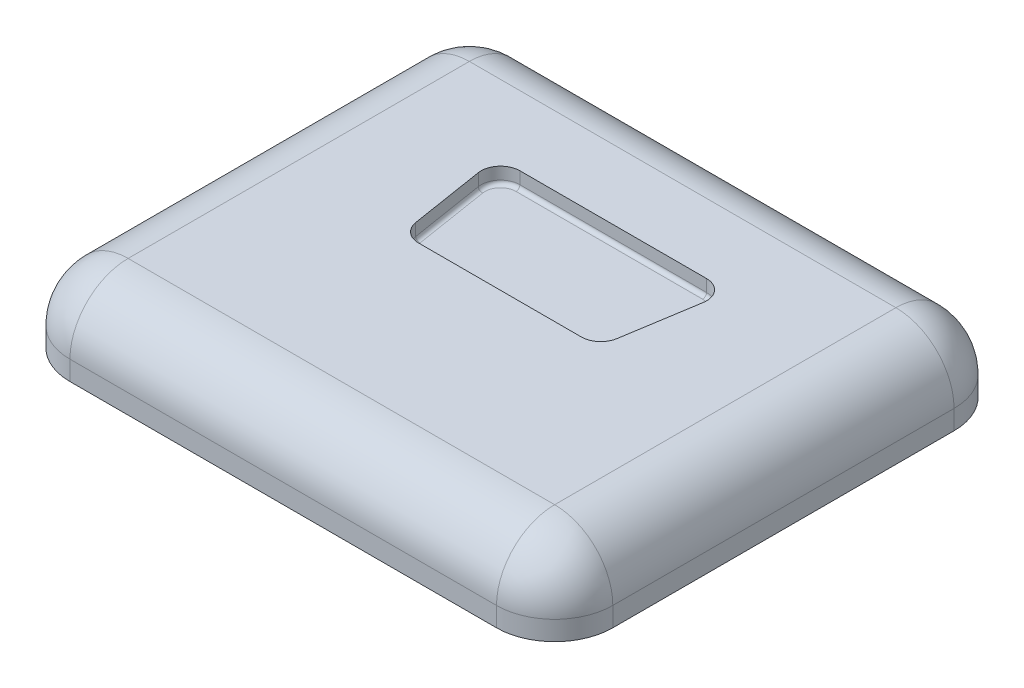
ISO-10303-21;
HEADER;
FILE_DESCRIPTION(('STEP AP214'),'2;1');
FILE_NAME('part.step','',(''),(''),'','','');
FILE_SCHEMA(('AUTOMOTIVE_DESIGN { 1 0 10303 214 1 1 1 1 }'));
ENDSEC;
DATA;
#1=APPLICATION_CONTEXT('core data for automotive mechanical design processes');
#2=APPLICATION_PROTOCOL_DEFINITION('international standard','automotive_design',2000,#1);
#3=PRODUCT_CONTEXT('',#1,'mechanical');
#4=PRODUCT('Part','Part','',(#3));
#5=PRODUCT_RELATED_PRODUCT_CATEGORY('part','',(#4));
#6=PRODUCT_DEFINITION_FORMATION('','',#4);
#7=PRODUCT_DEFINITION_CONTEXT('part definition',#1,'design');
#8=PRODUCT_DEFINITION('design','',#6,#7);
#9=PRODUCT_DEFINITION_SHAPE('','',#8);
#10=(LENGTH_UNIT() NAMED_UNIT(*) SI_UNIT(.MILLI.,.METRE.));
#11=(NAMED_UNIT(*) PLANE_ANGLE_UNIT() SI_UNIT($,.RADIAN.));
#12=(NAMED_UNIT(*) SI_UNIT($,.STERADIAN.) SOLID_ANGLE_UNIT());
#13=UNCERTAINTY_MEASURE_WITH_UNIT(LENGTH_MEASURE(1.E-05),#10,'distance_accuracy_value','');
#14=(GEOMETRIC_REPRESENTATION_CONTEXT(3) GLOBAL_UNCERTAINTY_ASSIGNED_CONTEXT((#13)) GLOBAL_UNIT_ASSIGNED_CONTEXT((#10,
#11,#12)) REPRESENTATION_CONTEXT('',''));
#15=CARTESIAN_POINT('',(0.,0.,0.));
#16=DIRECTION('',(0.,0.,1.));
#17=DIRECTION('',(1.,0.,0.));
#18=AXIS2_PLACEMENT_3D('',#15,#16,#17);
#19=CARTESIAN_POINT('',(-112.56,40.,-82.94));
#20=DIRECTION('',(1.,0.,0.));
#21=DIRECTION('',(0.,0.,-1.));
#22=AXIS2_PLACEMENT_3D('',#19,#20,#21);
#23=PLANE('',#22);
#24=DIRECTION('',(0.,0.,1.));
#25=VECTOR('',#24,1.);
#26=CARTESIAN_POINT('',(-112.56,10.,-82.94));
#27=LINE('',#26,#25);
#28=CARTESIAN_POINT('',(-112.56,10.,123.06));
#29=VERTEX_POINT('',#28);
#30=CARTESIAN_POINT('',(-112.56,10.,-52.94));
#31=VERTEX_POINT('',#30);
#32=EDGE_CURVE('E319',#29,#31,#27,.F.);
#33=ORIENTED_EDGE('',*,*,#32,.T.);
#34=DIRECTION('',(0.,-1.,0.));
#35=VECTOR('',#34,1.);
#36=CARTESIAN_POINT('',(-112.56,0.,-52.94));
#37=LINE('',#36,#35);
#38=CARTESIAN_POINT('',(-112.56,0.,-52.94));
#39=VERTEX_POINT('',#38);
#40=EDGE_CURVE('E322',#31,#39,#37,.T.);
#41=ORIENTED_EDGE('',*,*,#40,.T.);
#42=DIRECTION('',(0.,0.,1.));
#43=VECTOR('',#42,1.);
#44=CARTESIAN_POINT('',(-112.56,0.,-82.94));
#45=LINE('',#44,#43);
#46=CARTESIAN_POINT('',(-112.56,0.,123.06));
#47=VERTEX_POINT('',#46);
#48=EDGE_CURVE('E258',#39,#47,#45,.T.);
#49=ORIENTED_EDGE('',*,*,#48,.T.);
#50=DIRECTION('',(0.,-1.,0.));
#51=VECTOR('',#50,1.);
#52=CARTESIAN_POINT('',(-112.56,40.,123.06));
#53=LINE('',#52,#51);
#54=EDGE_CURVE('E316',#47,#29,#53,.F.);
#55=ORIENTED_EDGE('',*,*,#54,.T.);
#56=EDGE_LOOP('',(#33,#41,#49,#55));
#57=FACE_BOUND('',#56,.T.);
#58=ADVANCED_FACE('F42',(#57),#23,.F.);
#59=CARTESIAN_POINT('',(-112.56,40.,153.06));
#60=DIRECTION('',(0.,0.,-1.));
#61=DIRECTION('',(-1.,0.,0.));
#62=AXIS2_PLACEMENT_3D('',#59,#60,#61);
#63=PLANE('',#62);
#64=DIRECTION('',(1.,0.,0.));
#65=VECTOR('',#64,1.);
#66=CARTESIAN_POINT('',(-112.56,10.,153.06));
#67=LINE('',#66,#65);
#68=CARTESIAN_POINT('',(137.44,10.,153.06));
#69=VERTEX_POINT('',#68);
#70=CARTESIAN_POINT('',(-82.5599999999999,10.,153.06));
#71=VERTEX_POINT('',#70);
#72=EDGE_CURVE('E310',#69,#71,#67,.F.);
#73=ORIENTED_EDGE('',*,*,#72,.T.);
#74=DIRECTION('',(0.,-1.,0.));
#75=VECTOR('',#74,1.);
#76=CARTESIAN_POINT('',(-82.5599999999999,40.,153.06));
#77=LINE('',#76,#75);
#78=CARTESIAN_POINT('',(-82.5599999999999,0.,153.06));
#79=VERTEX_POINT('',#78);
#80=EDGE_CURVE('E313',#71,#79,#77,.T.);
#81=ORIENTED_EDGE('',*,*,#80,.T.);
#82=DIRECTION('',(1.,0.,0.));
#83=VECTOR('',#82,1.);
#84=CARTESIAN_POINT('',(-112.56,0.,153.06));
#85=LINE('',#84,#83);
#86=CARTESIAN_POINT('',(137.44,0.,153.06));
#87=VERTEX_POINT('',#86);
#88=EDGE_CURVE('E262',#79,#87,#85,.T.);
#89=ORIENTED_EDGE('',*,*,#88,.T.);
#90=DIRECTION('',(0.,-1.,0.));
#91=VECTOR('',#90,1.);
#92=CARTESIAN_POINT('',(137.44,40.,153.06));
#93=LINE('',#92,#91);
#94=EDGE_CURVE('E307',#87,#69,#93,.F.);
#95=ORIENTED_EDGE('',*,*,#94,.T.);
#96=EDGE_LOOP('',(#73,#81,#89,#95));
#97=FACE_BOUND('',#96,.T.);
#98=ADVANCED_FACE('F520',(#97),#63,.F.);
#99=CARTESIAN_POINT('',(167.44,40.,-82.94));
#100=DIRECTION('',(1.,0.,0.));
#101=DIRECTION('',(0.,0.,-1.));
#102=AXIS2_PLACEMENT_3D('',#99,#100,#101);
#103=PLANE('',#102);
#104=DIRECTION('',(0.,0.,1.));
#105=VECTOR('',#104,1.);
#106=CARTESIAN_POINT('',(167.44,0.,-82.94));
#107=LINE('',#106,#105);
#108=CARTESIAN_POINT('',(167.44,0.,-52.94));
#109=VERTEX_POINT('',#108);
#110=CARTESIAN_POINT('',(167.44,0.,123.06));
#111=VERTEX_POINT('',#110);
#112=EDGE_CURVE('E267',#109,#111,#107,.T.);
#113=ORIENTED_EDGE('',*,*,#112,.F.);
#114=DIRECTION('',(0.,-1.,0.));
#115=VECTOR('',#114,1.);
#116=CARTESIAN_POINT('',(167.44,40.,-52.94));
#117=LINE('',#116,#115);
#118=CARTESIAN_POINT('',(167.44,10.,-52.94));
#119=VERTEX_POINT('',#118);
#120=EDGE_CURVE('E304',#109,#119,#117,.F.);
#121=ORIENTED_EDGE('',*,*,#120,.T.);
#122=DIRECTION('',(0.,0.,1.));
#123=VECTOR('',#122,1.);
#124=CARTESIAN_POINT('',(167.44,10.,-82.94));
#125=LINE('',#124,#123);
#126=CARTESIAN_POINT('',(167.44,10.,123.06));
#127=VERTEX_POINT('',#126);
#128=EDGE_CURVE('E301',#119,#127,#125,.T.);
#129=ORIENTED_EDGE('',*,*,#128,.T.);
#130=DIRECTION('',(0.,-1.,0.));
#131=VECTOR('',#130,1.);
#132=CARTESIAN_POINT('',(167.44,0.,123.06));
#133=LINE('',#132,#131);
#134=EDGE_CURVE('E298',#127,#111,#133,.T.);
#135=ORIENTED_EDGE('',*,*,#134,.T.);
#136=EDGE_LOOP('',(#113,#121,#129,#135));
#137=FACE_BOUND('',#136,.T.);
#138=ADVANCED_FACE('F526',(#137),#103,.T.);
#139=CARTESIAN_POINT('',(-112.56,40.,-82.94));
#140=DIRECTION('',(0.,0.,-1.));
#141=DIRECTION('',(-1.,0.,0.));
#142=AXIS2_PLACEMENT_3D('',#139,#140,#141);
#143=PLANE('',#142);
#144=DIRECTION('',(1.,0.,0.));
#145=VECTOR('',#144,1.);
#146=CARTESIAN_POINT('',(-112.56,10.,-82.94));
#147=LINE('',#146,#145);
#148=CARTESIAN_POINT('',(-82.5599999999999,10.,-82.94));
#149=VERTEX_POINT('',#148);
#150=CARTESIAN_POINT('',(137.44,10.,-82.94));
#151=VERTEX_POINT('',#150);
#152=EDGE_CURVE('E278',#149,#151,#147,.T.);
#153=ORIENTED_EDGE('',*,*,#152,.T.);
#154=DIRECTION('',(0.,-1.,0.));
#155=VECTOR('',#154,1.);
#156=CARTESIAN_POINT('',(137.44,40.,-82.94));
#157=LINE('',#156,#155);
#158=CARTESIAN_POINT('',(137.44,0.,-82.94));
#159=VERTEX_POINT('',#158);
#160=EDGE_CURVE('E282',#151,#159,#157,.T.);
#161=ORIENTED_EDGE('',*,*,#160,.T.);
#162=DIRECTION('',(1.,0.,0.));
#163=VECTOR('',#162,1.);
#164=CARTESIAN_POINT('',(-112.56,0.,-82.94));
#165=LINE('',#164,#163);
#166=CARTESIAN_POINT('',(-82.5599999999999,0.,-82.94));
#167=VERTEX_POINT('',#166);
#168=EDGE_CURVE('E271',#167,#159,#165,.T.);
#169=ORIENTED_EDGE('',*,*,#168,.F.);
#170=DIRECTION('',(0.,-1.,0.));
#171=VECTOR('',#170,1.);
#172=CARTESIAN_POINT('',(-82.5599999999999,40.,-82.94));
#173=LINE('',#172,#171);
#174=EDGE_CURVE('E275',#167,#149,#173,.F.);
#175=ORIENTED_EDGE('',*,*,#174,.T.);
#176=EDGE_LOOP('',(#153,#161,#169,#175));
#177=FACE_BOUND('',#176,.T.);
#178=ADVANCED_FACE('F833',(#177),#143,.T.);
#179=CARTESIAN_POINT('',(0.,40.,0.));
#180=DIRECTION('',(0.,1.,0.));
#181=DIRECTION('',(0.,0.,1.));
#182=AXIS2_PLACEMENT_3D('',#179,#180,#181);
#183=PLANE('',#182);
#184=CARTESIAN_POINT('',(-14.5599999999999,40.,31.26));
#185=DIRECTION('',(0.,1.,0.));
#186=DIRECTION('',(0.,0.,1.));
#187=AXIS2_PLACEMENT_3D('',#184,#185,#186);
#188=CIRCLE('',#187,10.);
#189=CARTESIAN_POINT('',(-24.4351744166853,40.,32.83509689862));
#190=VERTEX_POINT('',#189);
#191=CARTESIAN_POINT('',(-14.5599999999999,40.,41.26));
#192=VERTEX_POINT('',#191);
#193=EDGE_CURVE('E209',#190,#192,#188,.T.);
#194=ORIENTED_EDGE('',*,*,#193,.F.);
#195=DIRECTION('',(0.157509689862002,0.,0.987517441668539));
#196=VECTOR('',#195,1.);
#197=CARTESIAN_POINT('',(-30.5599999999999,40.,-5.56490310137999));
#198=LINE('',#197,#196);
#199=CARTESIAN_POINT('',(-30.5599999999999,40.,-5.56490310137999));
#200=VERTEX_POINT('',#199);
#201=EDGE_CURVE('E234',#200,#190,#198,.T.);
#202=ORIENTED_EDGE('',*,*,#201,.F.);
#203=CARTESIAN_POINT('',(-20.6848255833145,40.,-7.14000000000001));
#204=DIRECTION('',(0.,1.,0.));
#205=DIRECTION('',(0.,0.,1.));
#206=AXIS2_PLACEMENT_3D('',#203,#204,#205);
#207=CIRCLE('',#206,10.);
#208=CARTESIAN_POINT('',(-20.6848255833145,40.,-17.14));
#209=VERTEX_POINT('',#208);
#210=EDGE_CURVE('E230',#209,#200,#207,.T.);
#211=ORIENTED_EDGE('',*,*,#210,.F.);
#212=DIRECTION('',(-1.,0.,0.));
#213=VECTOR('',#212,1.);
#214=CARTESIAN_POINT('',(-20.6848255833145,40.,-17.14));
#215=LINE('',#214,#213);
#216=CARTESIAN_POINT('',(75.5648255833147,40.,-17.14));
#217=VERTEX_POINT('',#216);
#218=EDGE_CURVE('E226',#217,#209,#215,.T.);
#219=ORIENTED_EDGE('',*,*,#218,.F.);
#220=CARTESIAN_POINT('',(75.5648255833147,40.,-7.14000000000001));
#221=DIRECTION('',(0.,1.,0.));
#222=DIRECTION('',(0.,0.,-1.));
#223=AXIS2_PLACEMENT_3D('',#220,#221,#222);
#224=CIRCLE('',#223,10.);
#225=CARTESIAN_POINT('',(85.4400000000001,40.,-5.56490310137999));
#226=VERTEX_POINT('',#225);
#227=EDGE_CURVE('E219',#226,#217,#224,.T.);
#228=ORIENTED_EDGE('',*,*,#227,.F.);
#229=DIRECTION('',(0.157509689862002,0.,-0.987517441668539));
#230=VECTOR('',#229,1.);
#231=CARTESIAN_POINT('',(85.4400000000001,40.,-5.56490310137999));
#232=LINE('',#231,#230);
#233=CARTESIAN_POINT('',(79.3151744166855,40.,32.83509689862));
#234=VERTEX_POINT('',#233);
#235=EDGE_CURVE('E215',#234,#226,#232,.T.);
#236=ORIENTED_EDGE('',*,*,#235,.F.);
#237=CARTESIAN_POINT('',(69.4400000000001,40.,31.26));
#238=DIRECTION('',(0.,1.,0.));
#239=DIRECTION('',(0.,0.,1.));
#240=AXIS2_PLACEMENT_3D('',#237,#238,#239);
#241=CIRCLE('',#240,10.);
#242=CARTESIAN_POINT('',(69.4400000000001,40.,41.26));
#243=VERTEX_POINT('',#242);
#244=EDGE_CURVE('E195',#243,#234,#241,.T.);
#245=ORIENTED_EDGE('',*,*,#244,.F.);
#246=DIRECTION('',(1.,0.,0.));
#247=VECTOR('',#246,1.);
#248=CARTESIAN_POINT('',(-14.5599999999999,40.,41.26));
#249=LINE('',#248,#247);
#250=EDGE_CURVE('E203',#192,#243,#249,.T.);
#251=ORIENTED_EDGE('',*,*,#250,.F.);
#252=EDGE_LOOP('',(#194,#202,#211,#219,#228,#236,#245,#251));
#253=FACE_BOUND('',#252,.T.);
#254=DIRECTION('',(0.,0.,1.));
#255=VECTOR('',#254,1.);
#256=CARTESIAN_POINT('',(137.44,40.,0.));
#257=LINE('',#256,#255);
#258=CARTESIAN_POINT('',(137.44,40.,123.06));
#259=VERTEX_POINT('',#258);
#260=CARTESIAN_POINT('',(137.44,40.,-52.94));
#261=VERTEX_POINT('',#260);
#262=EDGE_CURVE('E291',#259,#261,#257,.F.);
#263=ORIENTED_EDGE('',*,*,#262,.T.);
#264=DIRECTION('',(1.,0.,0.));
#265=VECTOR('',#264,1.);
#266=CARTESIAN_POINT('',(0.,40.,-52.94));
#267=LINE('',#266,#265);
#268=CARTESIAN_POINT('',(-82.5599999999999,40.,-52.94));
#269=VERTEX_POINT('',#268);
#270=EDGE_CURVE('E294',#261,#269,#267,.F.);
#271=ORIENTED_EDGE('',*,*,#270,.T.);
#272=DIRECTION('',(0.,0.,1.));
#273=VECTOR('',#272,1.);
#274=CARTESIAN_POINT('',(-82.5599999999999,40.,153.06));
#275=LINE('',#274,#273);
#276=CARTESIAN_POINT('',(-82.5599999999999,40.,123.06));
#277=VERTEX_POINT('',#276);
#278=EDGE_CURVE('E285',#269,#277,#275,.T.);
#279=ORIENTED_EDGE('',*,*,#278,.T.);
#280=DIRECTION('',(1.,0.,0.));
#281=VECTOR('',#280,1.);
#282=CARTESIAN_POINT('',(167.44,40.,123.06));
#283=LINE('',#282,#281);
#284=EDGE_CURVE('E288',#277,#259,#283,.T.);
#285=ORIENTED_EDGE('',*,*,#284,.T.);
#286=EDGE_LOOP('',(#263,#271,#279,#285));
#287=FACE_BOUND('',#286,.T.);
#288=ADVANCED_FACE('F211',(#253,#287),#183,.T.);
#289=CARTESIAN_POINT('',(0.,0.,0.));
#290=DIRECTION('',(0.,1.,0.));
#291=DIRECTION('',(0.,0.,1.));
#292=AXIS2_PLACEMENT_3D('',#289,#290,#291);
#293=PLANE('',#292);
#294=ORIENTED_EDGE('',*,*,#168,.T.);
#295=CARTESIAN_POINT('',(137.44,0.,-52.94));
#296=DIRECTION('',(0.,1.,0.));
#297=DIRECTION('',(0.,0.,1.));
#298=AXIS2_PLACEMENT_3D('',#295,#296,#297);
#299=CIRCLE('',#298,30.);
#300=EDGE_CURVE('E334',#159,#109,#299,.F.);
#301=ORIENTED_EDGE('',*,*,#300,.T.);
#302=ORIENTED_EDGE('',*,*,#112,.T.);
#303=CARTESIAN_POINT('',(137.44,0.,123.06));
#304=DIRECTION('',(0.,1.,0.));
#305=DIRECTION('',(0.,0.,1.));
#306=AXIS2_PLACEMENT_3D('',#303,#304,#305);
#307=CIRCLE('',#306,30.);
#308=EDGE_CURVE('E325',#111,#87,#307,.F.);
#309=ORIENTED_EDGE('',*,*,#308,.T.);
#310=ORIENTED_EDGE('',*,*,#88,.F.);
#311=CARTESIAN_POINT('',(-82.5599999999999,0.,123.06));
#312=DIRECTION('',(0.,1.,0.));
#313=DIRECTION('',(0.,0.,1.));
#314=AXIS2_PLACEMENT_3D('',#311,#312,#313);
#315=CIRCLE('',#314,30.);
#316=EDGE_CURVE('E328',#79,#47,#315,.F.);
#317=ORIENTED_EDGE('',*,*,#316,.T.);
#318=ORIENTED_EDGE('',*,*,#48,.F.);
#319=CARTESIAN_POINT('',(-82.5599999999999,0.,-52.94));
#320=DIRECTION('',(0.,1.,0.));
#321=DIRECTION('',(0.,0.,1.));
#322=AXIS2_PLACEMENT_3D('',#319,#320,#321);
#323=CIRCLE('',#322,30.);
#324=EDGE_CURVE('E331',#39,#167,#323,.F.);
#325=ORIENTED_EDGE('',*,*,#324,.T.);
#326=EDGE_LOOP('',(#294,#301,#302,#309,#310,#317,#318,#325));
#327=FACE_BOUND('',#326,.T.);
#328=ADVANCED_FACE('F578',(#327),#293,.F.);
#329=CARTESIAN_POINT('',(-82.5599999999999,40.,123.06));
#330=DIRECTION('',(0.,-1.,0.));
#331=DIRECTION('',(0.,0.,-1.));
#332=AXIS2_PLACEMENT_3D('',#329,#330,#331);
#333=CYLINDRICAL_SURFACE('',#332,30.);
#334=ORIENTED_EDGE('',*,*,#316,.F.);
#335=ORIENTED_EDGE('',*,*,#80,.F.);
#336=CARTESIAN_POINT('',(-82.5599999999999,10.,123.06));
#337=DIRECTION('',(0.,1.,0.));
#338=DIRECTION('',(0.,0.,1.));
#339=AXIS2_PLACEMENT_3D('',#336,#337,#338);
#340=CIRCLE('',#339,30.);
#341=EDGE_CURVE('E375',#29,#71,#340,.T.);
#342=ORIENTED_EDGE('',*,*,#341,.F.);
#343=ORIENTED_EDGE('',*,*,#54,.F.);
#344=EDGE_LOOP('',(#334,#335,#342,#343));
#345=FACE_BOUND('',#344,.T.);
#346=ADVANCED_FACE('F574',(#345),#333,.T.);
#347=CARTESIAN_POINT('',(137.44,40.,123.06));
#348=DIRECTION('',(0.,1.,0.));
#349=DIRECTION('',(0.,0.,1.));
#350=AXIS2_PLACEMENT_3D('',#347,#348,#349);
#351=CYLINDRICAL_SURFACE('',#350,30.);
#352=ORIENTED_EDGE('',*,*,#308,.F.);
#353=ORIENTED_EDGE('',*,*,#134,.F.);
#354=CARTESIAN_POINT('',(137.44,10.,123.06));
#355=DIRECTION('',(0.,1.,0.));
#356=DIRECTION('',(0.,0.,1.));
#357=AXIS2_PLACEMENT_3D('',#354,#355,#356);
#358=CIRCLE('',#357,30.);
#359=EDGE_CURVE('E371',#69,#127,#358,.T.);
#360=ORIENTED_EDGE('',*,*,#359,.F.);
#361=ORIENTED_EDGE('',*,*,#94,.F.);
#362=EDGE_LOOP('',(#352,#353,#360,#361));
#363=FACE_BOUND('',#362,.T.);
#364=ADVANCED_FACE('F570',(#363),#351,.T.);
#365=CARTESIAN_POINT('',(0.,10.,123.06));
#366=DIRECTION('',(-1.,0.,0.));
#367=DIRECTION('',(0.,0.,1.));
#368=AXIS2_PLACEMENT_3D('',#365,#366,#367);
#369=CYLINDRICAL_SURFACE('',#368,30.);
#370=CARTESIAN_POINT('',(-82.5599999999999,10.,123.06));
#371=DIRECTION('',(-1.,0.,0.));
#372=DIRECTION('',(0.,0.,1.));
#373=AXIS2_PLACEMENT_3D('',#370,#371,#372);
#374=CIRCLE('',#373,30.);
#375=EDGE_CURVE('E263',#71,#277,#374,.T.);
#376=ORIENTED_EDGE('',*,*,#375,.F.);
#377=ORIENTED_EDGE('',*,*,#72,.F.);
#378=CARTESIAN_POINT('',(137.44,10.,123.06));
#379=DIRECTION('',(1.,0.,0.));
#380=DIRECTION('',(0.,0.,-1.));
#381=AXIS2_PLACEMENT_3D('',#378,#379,#380);
#382=CIRCLE('',#381,30.);
#383=EDGE_CURVE('E367',#259,#69,#382,.T.);
#384=ORIENTED_EDGE('',*,*,#383,.F.);
#385=ORIENTED_EDGE('',*,*,#284,.F.);
#386=EDGE_LOOP('',(#376,#377,#384,#385));
#387=FACE_BOUND('',#386,.T.);
#388=ADVANCED_FACE('F566',(#387),#369,.T.);
#389=CARTESIAN_POINT('',(-82.5599999999999,10.,123.06));
#390=DIRECTION('',(0.,0.,1.));
#391=DIRECTION('',(1.,0.,0.));
#392=AXIS2_PLACEMENT_3D('',#389,#390,#391);
#393=SPHERICAL_SURFACE('',#392,30.);
#394=ORIENTED_EDGE('',*,*,#341,.T.);
#395=ORIENTED_EDGE('',*,*,#375,.T.);
#396=CARTESIAN_POINT('',(-82.5599999999999,10.,123.06));
#397=DIRECTION('',(0.,0.,1.));
#398=DIRECTION('',(1.,0.,0.));
#399=AXIS2_PLACEMENT_3D('',#396,#397,#398);
#400=CIRCLE('',#399,30.);
#401=EDGE_CURVE('E363',#29,#277,#400,.F.);
#402=ORIENTED_EDGE('',*,*,#401,.F.);
#403=EDGE_LOOP('',(#394,#395,#402));
#404=FACE_BOUND('',#403,.T.);
#405=ADVANCED_FACE('F562',(#404),#393,.T.);
#406=CARTESIAN_POINT('',(137.44,10.,123.06));
#407=DIRECTION('',(0.,0.,1.));
#408=DIRECTION('',(1.,0.,0.));
#409=AXIS2_PLACEMENT_3D('',#406,#407,#408);
#410=SPHERICAL_SURFACE('',#409,30.);
#411=ORIENTED_EDGE('',*,*,#383,.T.);
#412=ORIENTED_EDGE('',*,*,#359,.T.);
#413=CARTESIAN_POINT('',(137.44,10.,123.06));
#414=DIRECTION('',(0.,0.,1.));
#415=DIRECTION('',(1.,0.,0.));
#416=AXIS2_PLACEMENT_3D('',#413,#414,#415);
#417=CIRCLE('',#416,30.);
#418=EDGE_CURVE('E359',#259,#127,#417,.F.);
#419=ORIENTED_EDGE('',*,*,#418,.F.);
#420=EDGE_LOOP('',(#411,#412,#419));
#421=FACE_BOUND('',#420,.T.);
#422=ADVANCED_FACE('F558',(#421),#410,.T.);
#423=CARTESIAN_POINT('',(-82.5599999999999,10.,0.));
#424=DIRECTION('',(0.,0.,-1.));
#425=DIRECTION('',(-1.,0.,0.));
#426=AXIS2_PLACEMENT_3D('',#423,#424,#425);
#427=CYLINDRICAL_SURFACE('',#426,30.);
#428=ORIENTED_EDGE('',*,*,#401,.T.);
#429=ORIENTED_EDGE('',*,*,#278,.F.);
#430=CARTESIAN_POINT('',(-82.5599999999999,10.,-52.94));
#431=DIRECTION('',(0.,0.,-1.));
#432=DIRECTION('',(-1.,0.,0.));
#433=AXIS2_PLACEMENT_3D('',#430,#431,#432);
#434=CIRCLE('',#433,30.);
#435=EDGE_CURVE('E355',#31,#269,#434,.T.);
#436=ORIENTED_EDGE('',*,*,#435,.F.);
#437=ORIENTED_EDGE('',*,*,#32,.F.);
#438=EDGE_LOOP('',(#428,#429,#436,#437));
#439=FACE_BOUND('',#438,.T.);
#440=ADVANCED_FACE('F554',(#439),#427,.T.);
#441=CARTESIAN_POINT('',(-82.5599999999999,40.,-52.94));
#442=DIRECTION('',(0.,1.,0.));
#443=DIRECTION('',(0.,0.,1.));
#444=AXIS2_PLACEMENT_3D('',#441,#442,#443);
#445=CYLINDRICAL_SURFACE('',#444,30.);
#446=ORIENTED_EDGE('',*,*,#324,.F.);
#447=ORIENTED_EDGE('',*,*,#40,.F.);
#448=CARTESIAN_POINT('',(-82.5599999999999,10.,-52.94));
#449=DIRECTION('',(0.,1.,0.));
#450=DIRECTION('',(0.,0.,1.));
#451=AXIS2_PLACEMENT_3D('',#448,#449,#450);
#452=CIRCLE('',#451,30.);
#453=EDGE_CURVE('E351',#149,#31,#452,.T.);
#454=ORIENTED_EDGE('',*,*,#453,.F.);
#455=ORIENTED_EDGE('',*,*,#174,.F.);
#456=EDGE_LOOP('',(#446,#447,#454,#455));
#457=FACE_BOUND('',#456,.T.);
#458=ADVANCED_FACE('F550',(#457),#445,.T.);
#459=CARTESIAN_POINT('',(137.44,40.,-52.94));
#460=DIRECTION('',(0.,-1.,0.));
#461=DIRECTION('',(0.,0.,-1.));
#462=AXIS2_PLACEMENT_3D('',#459,#460,#461);
#463=CYLINDRICAL_SURFACE('',#462,30.);
#464=ORIENTED_EDGE('',*,*,#300,.F.);
#465=ORIENTED_EDGE('',*,*,#160,.F.);
#466=CARTESIAN_POINT('',(137.44,10.,-52.94));
#467=DIRECTION('',(0.,1.,0.));
#468=DIRECTION('',(0.,0.,1.));
#469=AXIS2_PLACEMENT_3D('',#466,#467,#468);
#470=CIRCLE('',#469,30.);
#471=EDGE_CURVE('E347',#119,#151,#470,.T.);
#472=ORIENTED_EDGE('',*,*,#471,.F.);
#473=ORIENTED_EDGE('',*,*,#120,.F.);
#474=EDGE_LOOP('',(#464,#465,#472,#473));
#475=FACE_BOUND('',#474,.T.);
#476=ADVANCED_FACE('F546',(#475),#463,.T.);
#477=CARTESIAN_POINT('',(137.44,10.,-82.94));
#478=DIRECTION('',(0.,0.,1.));
#479=DIRECTION('',(1.,0.,0.));
#480=AXIS2_PLACEMENT_3D('',#477,#478,#479);
#481=CYLINDRICAL_SURFACE('',#480,30.);
#482=ORIENTED_EDGE('',*,*,#418,.T.);
#483=ORIENTED_EDGE('',*,*,#128,.F.);
#484=CARTESIAN_POINT('',(137.44,10.,-52.94));
#485=DIRECTION('',(0.,0.,-1.));
#486=DIRECTION('',(-1.,0.,0.));
#487=AXIS2_PLACEMENT_3D('',#484,#485,#486);
#488=CIRCLE('',#487,30.);
#489=EDGE_CURVE('E343',#261,#119,#488,.T.);
#490=ORIENTED_EDGE('',*,*,#489,.F.);
#491=ORIENTED_EDGE('',*,*,#262,.F.);
#492=EDGE_LOOP('',(#482,#483,#490,#491));
#493=FACE_BOUND('',#492,.T.);
#494=ADVANCED_FACE('F542',(#493),#481,.T.);
#495=CARTESIAN_POINT('',(-82.5599999999999,10.,-52.94));
#496=DIRECTION('',(-1.,0.,0.));
#497=DIRECTION('',(0.,0.,1.));
#498=AXIS2_PLACEMENT_3D('',#495,#496,#497);
#499=SPHERICAL_SURFACE('',#498,30.);
#500=ORIENTED_EDGE('',*,*,#453,.T.);
#501=ORIENTED_EDGE('',*,*,#435,.T.);
#502=CARTESIAN_POINT('',(-82.5599999999999,10.,-52.94));
#503=DIRECTION('',(-1.,0.,0.));
#504=DIRECTION('',(0.,0.,1.));
#505=AXIS2_PLACEMENT_3D('',#502,#503,#504);
#506=CIRCLE('',#505,30.);
#507=EDGE_CURVE('E340',#149,#269,#506,.F.);
#508=ORIENTED_EDGE('',*,*,#507,.F.);
#509=EDGE_LOOP('',(#500,#501,#508));
#510=FACE_BOUND('',#509,.T.);
#511=ADVANCED_FACE('F538',(#510),#499,.T.);
#512=CARTESIAN_POINT('',(137.44,10.,-52.94));
#513=DIRECTION('',(1.,0.,0.));
#514=DIRECTION('',(0.,0.,-1.));
#515=AXIS2_PLACEMENT_3D('',#512,#513,#514);
#516=SPHERICAL_SURFACE('',#515,30.);
#517=ORIENTED_EDGE('',*,*,#489,.T.);
#518=ORIENTED_EDGE('',*,*,#471,.T.);
#519=CARTESIAN_POINT('',(137.44,10.,-52.94));
#520=DIRECTION('',(1.,0.,0.));
#521=DIRECTION('',(0.,1.,0.));
#522=AXIS2_PLACEMENT_3D('',#519,#520,#521);
#523=CIRCLE('',#522,30.);
#524=EDGE_CURVE('E241',#261,#151,#523,.F.);
#525=ORIENTED_EDGE('',*,*,#524,.F.);
#526=EDGE_LOOP('',(#517,#518,#525));
#527=FACE_BOUND('',#526,.T.);
#528=ADVANCED_FACE('F534',(#527),#516,.T.);
#529=CARTESIAN_POINT('',(-112.56,10.,-52.94));
#530=DIRECTION('',(1.,0.,0.));
#531=DIRECTION('',(0.,0.,-1.));
#532=AXIS2_PLACEMENT_3D('',#529,#530,#531);
#533=CYLINDRICAL_SURFACE('',#532,30.);
#534=ORIENTED_EDGE('',*,*,#507,.T.);
#535=ORIENTED_EDGE('',*,*,#270,.F.);
#536=ORIENTED_EDGE('',*,*,#524,.T.);
#537=ORIENTED_EDGE('',*,*,#152,.F.);
#538=EDGE_LOOP('',(#534,#535,#536,#537));
#539=FACE_BOUND('',#538,.T.);
#540=ADVANCED_FACE('F531',(#539),#533,.T.);
#541=CARTESIAN_POINT('',(-14.5599999999999,31.75,31.26));
#542=DIRECTION('',(0.,1.,0.));
#543=DIRECTION('',(0.,0.,1.));
#544=AXIS2_PLACEMENT_3D('',#541,#542,#543);
#545=CYLINDRICAL_SURFACE('',#544,10.);
#546=DIRECTION('',(0.,1.,0.));
#547=VECTOR('',#546,1.);
#548=CARTESIAN_POINT('',(-14.5599999999999,31.75,41.26));
#549=LINE('',#548,#547);
#550=CARTESIAN_POINT('',(-14.5599999999999,33.75,41.26));
#551=VERTEX_POINT('',#550);
#552=EDGE_CURVE('E200',#551,#192,#549,.T.);
#553=ORIENTED_EDGE('',*,*,#552,.F.);
#554=CARTESIAN_POINT('',(-14.5599999999999,33.75,31.26));
#555=DIRECTION('',(0.,1.,0.));
#556=DIRECTION('',(0.,0.,1.));
#557=AXIS2_PLACEMENT_3D('',#554,#555,#556);
#558=CIRCLE('',#557,10.);
#559=CARTESIAN_POINT('',(-24.4351744166853,33.75,32.83509689862));
#560=VERTEX_POINT('',#559);
#561=EDGE_CURVE('E11',#551,#560,#558,.F.);
#562=ORIENTED_EDGE('',*,*,#561,.T.);
#563=DIRECTION('',(0.,1.,0.));
#564=VECTOR('',#563,1.);
#565=CARTESIAN_POINT('',(-24.4351744166853,31.75,32.83509689862));
#566=LINE('',#565,#564);
#567=EDGE_CURVE('E238',#560,#190,#566,.T.);
#568=ORIENTED_EDGE('',*,*,#567,.T.);
#569=ORIENTED_EDGE('',*,*,#193,.T.);
#570=EDGE_LOOP('',(#553,#562,#568,#569));
#571=FACE_BOUND('',#570,.T.);
#572=ADVANCED_FACE('F461',(#571),#545,.F.);
#573=CARTESIAN_POINT('',(-30.5599999999999,31.75,-5.56490310137999));
#574=DIRECTION('',(-0.987517441668539,0.,0.157509689862002));
#575=DIRECTION('',(0.157509689862002,0.,0.987517441668539));
#576=AXIS2_PLACEMENT_3D('',#573,#574,#575);
#577=PLANE('',#576);
#578=ORIENTED_EDGE('',*,*,#567,.F.);
#579=DIRECTION('',(0.157509689862002,0.,0.987517441668539));
#580=VECTOR('',#579,1.);
#581=CARTESIAN_POINT('',(-30.5599999999999,33.75,-5.56490310137999));
#582=LINE('',#581,#580);
#583=CARTESIAN_POINT('',(-30.5599999999999,33.75,-5.56490310137999));
#584=VERTEX_POINT('',#583);
#585=EDGE_CURVE('E406',#560,#584,#582,.F.);
#586=ORIENTED_EDGE('',*,*,#585,.T.);
#587=DIRECTION('',(0.,1.,0.));
#588=VECTOR('',#587,1.);
#589=CARTESIAN_POINT('',(-30.5599999999999,31.75,-5.56490310137999));
#590=LINE('',#589,#588);
#591=EDGE_CURVE('E242',#584,#200,#590,.T.);
#592=ORIENTED_EDGE('',*,*,#591,.T.);
#593=ORIENTED_EDGE('',*,*,#201,.T.);
#594=EDGE_LOOP('',(#578,#586,#592,#593));
#595=FACE_BOUND('',#594,.T.);
#596=ADVANCED_FACE('F468',(#595),#577,.F.);
#597=CARTESIAN_POINT('',(-20.6848255833145,31.75,-7.14000000000001));
#598=DIRECTION('',(0.,1.,0.));
#599=DIRECTION('',(0.,0.,1.));
#600=AXIS2_PLACEMENT_3D('',#597,#598,#599);
#601=CYLINDRICAL_SURFACE('',#600,10.);
#602=ORIENTED_EDGE('',*,*,#591,.F.);
#603=CARTESIAN_POINT('',(-20.6848255833145,33.75,-7.14000000000001));
#604=DIRECTION('',(0.,1.,0.));
#605=DIRECTION('',(0.,0.,1.));
#606=AXIS2_PLACEMENT_3D('',#603,#604,#605);
#607=CIRCLE('',#606,10.);
#608=CARTESIAN_POINT('',(-20.6848255833145,33.75,-17.14));
#609=VERTEX_POINT('',#608);
#610=EDGE_CURVE('E410',#584,#609,#607,.F.);
#611=ORIENTED_EDGE('',*,*,#610,.T.);
#612=DIRECTION('',(0.,1.,0.));
#613=VECTOR('',#612,1.);
#614=CARTESIAN_POINT('',(-20.6848255833145,31.75,-17.14));
#615=LINE('',#614,#613);
#616=EDGE_CURVE('E245',#609,#209,#615,.T.);
#617=ORIENTED_EDGE('',*,*,#616,.T.);
#618=ORIENTED_EDGE('',*,*,#210,.T.);
#619=EDGE_LOOP('',(#602,#611,#617,#618));
#620=FACE_BOUND('',#619,.T.);
#621=ADVANCED_FACE('F472',(#620),#601,.F.);
#622=CARTESIAN_POINT('',(-20.6848255833145,31.75,-17.14));
#623=DIRECTION('',(0.,0.,-1.));
#624=DIRECTION('',(-1.,0.,0.));
#625=AXIS2_PLACEMENT_3D('',#622,#623,#624);
#626=PLANE('',#625);
#627=ORIENTED_EDGE('',*,*,#616,.F.);
#628=DIRECTION('',(-1.,0.,0.));
#629=VECTOR('',#628,1.);
#630=CARTESIAN_POINT('',(-20.6848255833145,33.75,-17.14));
#631=LINE('',#630,#629);
#632=CARTESIAN_POINT('',(75.5648255833147,33.75,-17.14));
#633=VERTEX_POINT('',#632);
#634=EDGE_CURVE('E413',#609,#633,#631,.F.);
#635=ORIENTED_EDGE('',*,*,#634,.T.);
#636=DIRECTION('',(0.,1.,0.));
#637=VECTOR('',#636,1.);
#638=CARTESIAN_POINT('',(75.5648255833147,31.75,-17.14));
#639=LINE('',#638,#637);
#640=EDGE_CURVE('E248',#633,#217,#639,.T.);
#641=ORIENTED_EDGE('',*,*,#640,.T.);
#642=ORIENTED_EDGE('',*,*,#218,.T.);
#643=EDGE_LOOP('',(#627,#635,#641,#642));
#644=FACE_BOUND('',#643,.T.);
#645=ADVANCED_FACE('F477',(#644),#626,.F.);
#646=CARTESIAN_POINT('',(75.5648255833147,31.75,-7.14000000000001));
#647=DIRECTION('',(0.,1.,0.));
#648=DIRECTION('',(0.,0.,1.));
#649=AXIS2_PLACEMENT_3D('',#646,#647,#648);
#650=CYLINDRICAL_SURFACE('',#649,10.);
#651=ORIENTED_EDGE('',*,*,#640,.F.);
#652=CARTESIAN_POINT('',(75.5648255833147,33.75,-7.14000000000001));
#653=DIRECTION('',(0.,1.,0.));
#654=DIRECTION('',(0.,0.,1.));
#655=AXIS2_PLACEMENT_3D('',#652,#653,#654);
#656=CIRCLE('',#655,10.);
#657=CARTESIAN_POINT('',(85.4400000000001,33.75,-5.56490310137999));
#658=VERTEX_POINT('',#657);
#659=EDGE_CURVE('E416',#633,#658,#656,.F.);
#660=ORIENTED_EDGE('',*,*,#659,.T.);
#661=DIRECTION('',(0.,1.,0.));
#662=VECTOR('',#661,1.);
#663=CARTESIAN_POINT('',(85.4400000000001,31.75,-5.56490310137999));
#664=LINE('',#663,#662);
#665=EDGE_CURVE('E251',#658,#226,#664,.T.);
#666=ORIENTED_EDGE('',*,*,#665,.T.);
#667=ORIENTED_EDGE('',*,*,#227,.T.);
#668=EDGE_LOOP('',(#651,#660,#666,#667));
#669=FACE_BOUND('',#668,.T.);
#670=ADVANCED_FACE('F480',(#669),#650,.F.);
#671=CARTESIAN_POINT('',(85.4400000000001,31.75,-5.56490310137999));
#672=DIRECTION('',(0.987517441668539,0.,0.157509689862002));
#673=DIRECTION('',(0.157509689862002,0.,-0.987517441668539));
#674=AXIS2_PLACEMENT_3D('',#671,#672,#673);
#675=PLANE('',#674);
#676=ORIENTED_EDGE('',*,*,#665,.F.);
#677=DIRECTION('',(0.157509689862002,0.,-0.987517441668539));
#678=VECTOR('',#677,1.);
#679=CARTESIAN_POINT('',(85.4400000000001,33.75,-5.56490310137999));
#680=LINE('',#679,#678);
#681=CARTESIAN_POINT('',(79.3151744166855,33.75,32.83509689862));
#682=VERTEX_POINT('',#681);
#683=EDGE_CURVE('E419',#658,#682,#680,.F.);
#684=ORIENTED_EDGE('',*,*,#683,.T.);
#685=DIRECTION('',(0.,1.,0.));
#686=VECTOR('',#685,1.);
#687=CARTESIAN_POINT('',(79.3151744166855,31.75,32.83509689862));
#688=LINE('',#687,#686);
#689=EDGE_CURVE('E199',#682,#234,#688,.T.);
#690=ORIENTED_EDGE('',*,*,#689,.T.);
#691=ORIENTED_EDGE('',*,*,#235,.T.);
#692=EDGE_LOOP('',(#676,#684,#690,#691));
#693=FACE_BOUND('',#692,.T.);
#694=ADVANCED_FACE('F484',(#693),#675,.F.);
#695=CARTESIAN_POINT('',(69.4400000000001,31.75,31.26));
#696=DIRECTION('',(0.,1.,0.));
#697=DIRECTION('',(0.,0.,1.));
#698=AXIS2_PLACEMENT_3D('',#695,#696,#697);
#699=CYLINDRICAL_SURFACE('',#698,10.);
#700=ORIENTED_EDGE('',*,*,#689,.F.);
#701=CARTESIAN_POINT('',(69.4400000000001,33.75,31.26));
#702=DIRECTION('',(0.,1.,0.));
#703=DIRECTION('',(0.,0.,1.));
#704=AXIS2_PLACEMENT_3D('',#701,#702,#703);
#705=CIRCLE('',#704,10.);
#706=CARTESIAN_POINT('',(69.4400000000001,33.75,41.26));
#707=VERTEX_POINT('',#706);
#708=EDGE_CURVE('E67',#682,#707,#705,.F.);
#709=ORIENTED_EDGE('',*,*,#708,.T.);
#710=DIRECTION('',(0.,1.,0.));
#711=VECTOR('',#710,1.);
#712=CARTESIAN_POINT('',(69.4400000000001,31.75,41.26));
#713=LINE('',#712,#711);
#714=EDGE_CURVE('E191',#707,#243,#713,.T.);
#715=ORIENTED_EDGE('',*,*,#714,.T.);
#716=ORIENTED_EDGE('',*,*,#244,.T.);
#717=EDGE_LOOP('',(#700,#709,#715,#716));
#718=FACE_BOUND('',#717,.T.);
#719=ADVANCED_FACE('F193',(#718),#699,.F.);
#720=CARTESIAN_POINT('',(-14.5599999999999,31.75,41.26));
#721=DIRECTION('',(0.,0.,1.));
#722=DIRECTION('',(1.,0.,0.));
#723=AXIS2_PLACEMENT_3D('',#720,#721,#722);
#724=PLANE('',#723);
#725=ORIENTED_EDGE('',*,*,#714,.F.);
#726=DIRECTION('',(1.,0.,0.));
#727=VECTOR('',#726,1.);
#728=CARTESIAN_POINT('',(-14.5599999999999,33.75,41.26));
#729=LINE('',#728,#727);
#730=EDGE_CURVE('E52',#707,#551,#729,.F.);
#731=ORIENTED_EDGE('',*,*,#730,.T.);
#732=ORIENTED_EDGE('',*,*,#552,.T.);
#733=ORIENTED_EDGE('',*,*,#250,.T.);
#734=EDGE_LOOP('',(#725,#731,#732,#733));
#735=FACE_BOUND('',#734,.T.);
#736=ADVANCED_FACE('F204',(#735),#724,.F.);
#737=CARTESIAN_POINT('',(-14.5599999999999,31.75,31.26));
#738=DIRECTION('',(0.,1.,0.));
#739=DIRECTION('',(0.,0.,1.));
#740=AXIS2_PLACEMENT_3D('',#737,#738,#739);
#741=PLANE('',#740);
#742=CARTESIAN_POINT('',(-20.6848255833145,31.75,-7.14000000000001));
#743=DIRECTION('',(0.,1.,0.));
#744=DIRECTION('',(0.,0.,1.));
#745=AXIS2_PLACEMENT_3D('',#742,#743,#744);
#746=CIRCLE('',#745,8.);
#747=CARTESIAN_POINT('',(-20.6848255833145,31.75,-15.14));
#748=VERTEX_POINT('',#747);
#749=CARTESIAN_POINT('',(-28.5849651166628,31.75,-5.879922481104));
#750=VERTEX_POINT('',#749);
#751=EDGE_CURVE('E399',#748,#750,#746,.T.);
#752=ORIENTED_EDGE('',*,*,#751,.T.);
#753=DIRECTION('',(0.157509689862002,0.,0.987517441668539));
#754=VECTOR('',#753,1.);
#755=CARTESIAN_POINT('',(-22.4601395333482,31.75,32.520077518896));
#756=LINE('',#755,#754);
#757=CARTESIAN_POINT('',(-22.4601395333482,31.75,32.520077518896));
#758=VERTEX_POINT('',#757);
#759=EDGE_CURVE('E402',#750,#758,#756,.T.);
#760=ORIENTED_EDGE('',*,*,#759,.T.);
#761=CARTESIAN_POINT('',(-14.5599999999999,31.75,31.26));
#762=DIRECTION('',(0.,1.,0.));
#763=DIRECTION('',(0.,0.,1.));
#764=AXIS2_PLACEMENT_3D('',#761,#762,#763);
#765=CIRCLE('',#764,8.);
#766=CARTESIAN_POINT('',(-14.5599999999999,31.75,39.26));
#767=VERTEX_POINT('',#766);
#768=EDGE_CURVE('E337',#758,#767,#765,.T.);
#769=ORIENTED_EDGE('',*,*,#768,.T.);
#770=DIRECTION('',(1.,0.,0.));
#771=VECTOR('',#770,1.);
#772=CARTESIAN_POINT('',(-14.5599999999999,31.75,39.26));
#773=LINE('',#772,#771);
#774=CARTESIAN_POINT('',(69.4400000000001,31.75,39.26));
#775=VERTEX_POINT('',#774);
#776=EDGE_CURVE('E384',#767,#775,#773,.T.);
#777=ORIENTED_EDGE('',*,*,#776,.T.);
#778=CARTESIAN_POINT('',(69.4400000000001,31.75,31.26));
#779=DIRECTION('',(0.,1.,0.));
#780=DIRECTION('',(0.,0.,1.));
#781=AXIS2_PLACEMENT_3D('',#778,#779,#780);
#782=CIRCLE('',#781,8.);
#783=CARTESIAN_POINT('',(77.3401395333484,31.75,32.520077518896));
#784=VERTEX_POINT('',#783);
#785=EDGE_CURVE('E387',#775,#784,#782,.T.);
#786=ORIENTED_EDGE('',*,*,#785,.T.);
#787=DIRECTION('',(0.157509689862002,0.,-0.987517441668539));
#788=VECTOR('',#787,1.);
#789=CARTESIAN_POINT('',(75.2561581317128,31.75,45.5857370604204));
#790=LINE('',#789,#788);
#791=CARTESIAN_POINT('',(83.464965116663,31.75,-5.87992248110399));
#792=VERTEX_POINT('',#791);
#793=EDGE_CURVE('E390',#784,#792,#790,.T.);
#794=ORIENTED_EDGE('',*,*,#793,.T.);
#795=CARTESIAN_POINT('',(75.5648255833147,31.75,-7.14000000000001));
#796=DIRECTION('',(0.,1.,0.));
#797=DIRECTION('',(0.,0.,1.));
#798=AXIS2_PLACEMENT_3D('',#795,#796,#797);
#799=CIRCLE('',#798,8.);
#800=CARTESIAN_POINT('',(75.5648255833147,31.75,-15.14));
#801=VERTEX_POINT('',#800);
#802=EDGE_CURVE('E393',#792,#801,#799,.T.);
#803=ORIENTED_EDGE('',*,*,#802,.T.);
#804=DIRECTION('',(-1.,0.,0.));
#805=VECTOR('',#804,1.);
#806=CARTESIAN_POINT('',(-14.5599999999999,31.75,-15.14));
#807=LINE('',#806,#805);
#808=EDGE_CURVE('E396',#801,#748,#807,.T.);
#809=ORIENTED_EDGE('',*,*,#808,.T.);
#810=EDGE_LOOP('',(#752,#760,#769,#777,#786,#794,#803,#809));
#811=FACE_BOUND('',#810,.T.);
#812=ADVANCED_FACE('F510',(#811),#741,.T.);
#813=CARTESIAN_POINT('',(75.2561581317128,33.75,45.5857370604204));
#814=DIRECTION('',(0.157509689862002,0.,-0.987517441668539));
#815=DIRECTION('',(-0.987517441668539,0.,-0.157509689862002));
#816=AXIS2_PLACEMENT_3D('',#813,#814,#815);
#817=CYLINDRICAL_SURFACE('',#816,2.);
#818=CARTESIAN_POINT('',(77.3401395333484,33.75,32.520077518896));
#819=DIRECTION('',(0.157509689862002,0.,-0.987517441668539));
#820=DIRECTION('',(-0.987517441668539,0.,-0.157509689862002));
#821=AXIS2_PLACEMENT_3D('',#818,#819,#820);
#822=CIRCLE('',#821,2.);
#823=EDGE_CURVE('E447',#682,#784,#822,.T.);
#824=ORIENTED_EDGE('',*,*,#823,.F.);
#825=ORIENTED_EDGE('',*,*,#683,.F.);
#826=CARTESIAN_POINT('',(83.464965116663,33.75,-5.87992248110399));
#827=DIRECTION('',(-0.157509689862001,0.,0.987517441668539));
#828=DIRECTION('',(0.987517441668539,0.,0.157509689862001));
#829=AXIS2_PLACEMENT_3D('',#826,#827,#828);
#830=CIRCLE('',#829,2.);
#831=EDGE_CURVE('E46',#792,#658,#830,.T.);
#832=ORIENTED_EDGE('',*,*,#831,.F.);
#833=ORIENTED_EDGE('',*,*,#793,.F.);
#834=EDGE_LOOP('',(#824,#825,#832,#833));
#835=FACE_BOUND('',#834,.T.);
#836=ADVANCED_FACE('F44',(#835),#817,.F.);
#837=CARTESIAN_POINT('',(75.5648255833147,33.75,-7.14000000000001));
#838=DIRECTION('',(0.,1.,0.));
#839=DIRECTION('',(0.,0.,1.));
#840=AXIS2_PLACEMENT_3D('',#837,#838,#839);
#841=TOROIDAL_SURFACE('',#840,8.,2.);
#842=ORIENTED_EDGE('',*,*,#831,.T.);
#843=ORIENTED_EDGE('',*,*,#659,.F.);
#844=CARTESIAN_POINT('',(75.5648255833147,33.75,-15.14));
#845=DIRECTION('',(1.,0.,0.));
#846=DIRECTION('',(0.,0.,-1.));
#847=AXIS2_PLACEMENT_3D('',#844,#845,#846);
#848=CIRCLE('',#847,2.);
#849=EDGE_CURVE('E444',#801,#633,#848,.T.);
#850=ORIENTED_EDGE('',*,*,#849,.F.);
#851=ORIENTED_EDGE('',*,*,#802,.F.);
#852=EDGE_LOOP('',(#842,#843,#850,#851));
#853=FACE_BOUND('',#852,.T.);
#854=ADVANCED_FACE('F508',(#853),#841,.F.);
#855=CARTESIAN_POINT('',(69.4400000000001,33.75,31.26));
#856=DIRECTION('',(0.,1.,0.));
#857=DIRECTION('',(0.,0.,1.));
#858=AXIS2_PLACEMENT_3D('',#855,#856,#857);
#859=TOROIDAL_SURFACE('',#858,8.,2.);
#860=ORIENTED_EDGE('',*,*,#823,.T.);
#861=ORIENTED_EDGE('',*,*,#785,.F.);
#862=CARTESIAN_POINT('',(69.4400000000001,33.75,39.26));
#863=DIRECTION('',(1.,0.,0.));
#864=DIRECTION('',(0.,0.,-1.));
#865=AXIS2_PLACEMENT_3D('',#862,#863,#864);
#866=CIRCLE('',#865,2.);
#867=EDGE_CURVE('E440',#707,#775,#866,.T.);
#868=ORIENTED_EDGE('',*,*,#867,.F.);
#869=ORIENTED_EDGE('',*,*,#708,.F.);
#870=EDGE_LOOP('',(#860,#861,#868,#869));
#871=FACE_BOUND('',#870,.T.);
#872=ADVANCED_FACE('F487',(#871),#859,.F.);
#873=CARTESIAN_POINT('',(-14.5599999999999,33.75,-15.14));
#874=DIRECTION('',(-1.,0.,0.));
#875=DIRECTION('',(0.,0.,1.));
#876=AXIS2_PLACEMENT_3D('',#873,#874,#875);
#877=CYLINDRICAL_SURFACE('',#876,2.);
#878=ORIENTED_EDGE('',*,*,#849,.T.);
#879=ORIENTED_EDGE('',*,*,#634,.F.);
#880=CARTESIAN_POINT('',(-20.6848255833145,33.75,-15.14));
#881=DIRECTION('',(1.,0.,0.));
#882=DIRECTION('',(0.,0.,-1.));
#883=AXIS2_PLACEMENT_3D('',#880,#881,#882);
#884=CIRCLE('',#883,2.);
#885=EDGE_CURVE('E436',#748,#609,#884,.T.);
#886=ORIENTED_EDGE('',*,*,#885,.F.);
#887=ORIENTED_EDGE('',*,*,#808,.F.);
#888=EDGE_LOOP('',(#878,#879,#886,#887));
#889=FACE_BOUND('',#888,.T.);
#890=ADVANCED_FACE('F506',(#889),#877,.F.);
#891=CARTESIAN_POINT('',(-14.5599999999999,33.75,39.26));
#892=DIRECTION('',(1.,0.,0.));
#893=DIRECTION('',(0.,0.,-1.));
#894=AXIS2_PLACEMENT_3D('',#891,#892,#893);
#895=CYLINDRICAL_SURFACE('',#894,2.);
#896=ORIENTED_EDGE('',*,*,#867,.T.);
#897=ORIENTED_EDGE('',*,*,#776,.F.);
#898=CARTESIAN_POINT('',(-14.5599999999999,33.75,39.26));
#899=DIRECTION('',(1.,0.,0.));
#900=DIRECTION('',(0.,0.,-1.));
#901=AXIS2_PLACEMENT_3D('',#898,#899,#900);
#902=CIRCLE('',#901,2.);
#903=EDGE_CURVE('E432',#551,#767,#902,.T.);
#904=ORIENTED_EDGE('',*,*,#903,.F.);
#905=ORIENTED_EDGE('',*,*,#730,.F.);
#906=EDGE_LOOP('',(#896,#897,#904,#905));
#907=FACE_BOUND('',#906,.T.);
#908=ADVANCED_FACE('F490',(#907),#895,.F.);
#909=CARTESIAN_POINT('',(-20.6848255833145,33.75,-7.14000000000001));
#910=DIRECTION('',(0.,1.,0.));
#911=DIRECTION('',(0.,0.,1.));
#912=AXIS2_PLACEMENT_3D('',#909,#910,#911);
#913=TOROIDAL_SURFACE('',#912,8.,2.);
#914=ORIENTED_EDGE('',*,*,#885,.T.);
#915=ORIENTED_EDGE('',*,*,#610,.F.);
#916=CARTESIAN_POINT('',(-28.5849651166628,33.75,-5.879922481104));
#917=DIRECTION('',(-0.157509689862001,0.,-0.987517441668539));
#918=DIRECTION('',(-0.987517441668539,0.,0.157509689862001));
#919=AXIS2_PLACEMENT_3D('',#916,#917,#918);
#920=CIRCLE('',#919,2.);
#921=EDGE_CURVE('E429',#750,#584,#920,.T.);
#922=ORIENTED_EDGE('',*,*,#921,.F.);
#923=ORIENTED_EDGE('',*,*,#751,.F.);
#924=EDGE_LOOP('',(#914,#915,#922,#923));
#925=FACE_BOUND('',#924,.T.);
#926=ADVANCED_FACE('F502',(#925),#913,.F.);
#927=CARTESIAN_POINT('',(-14.5599999999999,33.75,31.26));
#928=DIRECTION('',(0.,1.,0.));
#929=DIRECTION('',(0.,0.,1.));
#930=AXIS2_PLACEMENT_3D('',#927,#928,#929);
#931=TOROIDAL_SURFACE('',#930,8.,2.);
#932=ORIENTED_EDGE('',*,*,#903,.T.);
#933=ORIENTED_EDGE('',*,*,#768,.F.);
#934=CARTESIAN_POINT('',(-22.4601395333482,33.75,32.520077518896));
#935=DIRECTION('',(0.157509689862001,0.,0.987517441668539));
#936=DIRECTION('',(0.987517441668539,0.,-0.157509689862001));
#937=AXIS2_PLACEMENT_3D('',#934,#935,#936);
#938=CIRCLE('',#937,2.);
#939=EDGE_CURVE('E426',#560,#758,#938,.T.);
#940=ORIENTED_EDGE('',*,*,#939,.F.);
#941=ORIENTED_EDGE('',*,*,#561,.F.);
#942=EDGE_LOOP('',(#932,#933,#940,#941));
#943=FACE_BOUND('',#942,.T.);
#944=ADVANCED_FACE('F495',(#943),#931,.F.);
#945=CARTESIAN_POINT('',(-22.4601395333482,33.75,32.520077518896));
#946=DIRECTION('',(0.157509689862002,0.,0.987517441668539));
#947=DIRECTION('',(0.987517441668539,0.,-0.157509689862002));
#948=AXIS2_PLACEMENT_3D('',#945,#946,#947);
#949=CYLINDRICAL_SURFACE('',#948,2.);
#950=ORIENTED_EDGE('',*,*,#921,.T.);
#951=ORIENTED_EDGE('',*,*,#585,.F.);
#952=ORIENTED_EDGE('',*,*,#939,.T.);
#953=ORIENTED_EDGE('',*,*,#759,.F.);
#954=EDGE_LOOP('',(#950,#951,#952,#953));
#955=FACE_BOUND('',#954,.T.);
#956=ADVANCED_FACE('F498',(#955),#949,.F.);
#957=CLOSED_SHELL('',(#58,#98,#138,#178,#288,#328,#346,#364,#388,#405,#422,#440,#458,#476,#494,
#511,#528,#540,#572,#596,#621,#645,#670,#694,#719,#736,#812,#836,#854,#872,#890,#908,#926,#944,#956));
#958=MANIFOLD_SOLID_BREP('B2',#957);
#959=ADVANCED_BREP_SHAPE_REPRESENTATION('',(#18,#958),#14);
#960=SHAPE_DEFINITION_REPRESENTATION(#9,#959);
ENDSEC;
END-ISO-10303-21;
